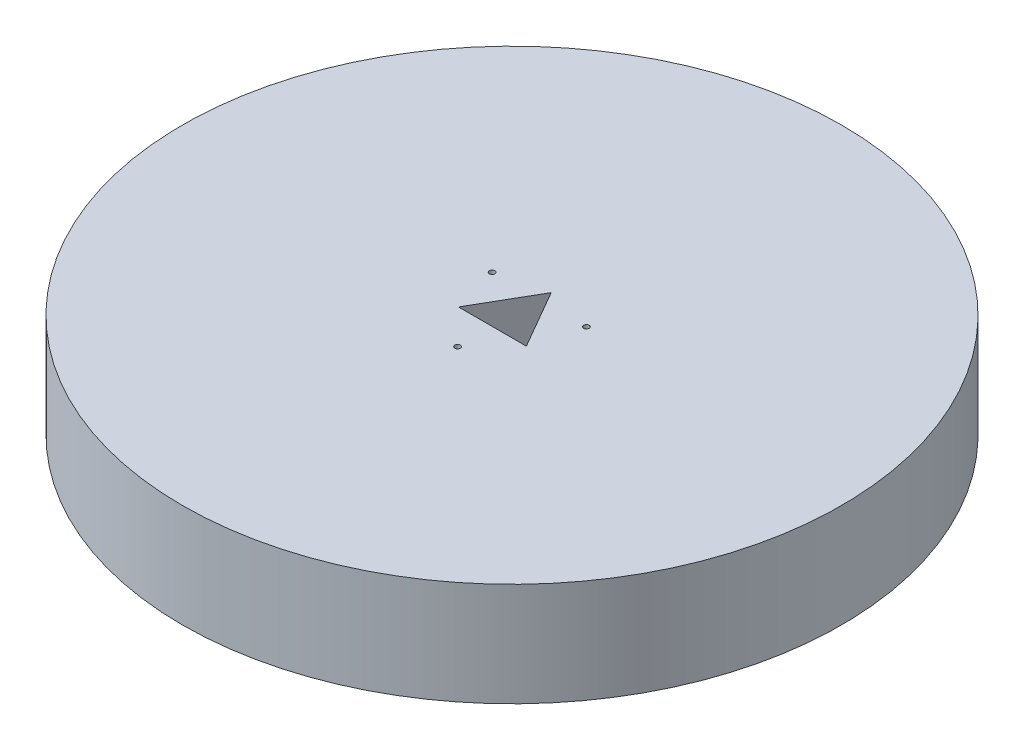
ISO-10303-21;
HEADER;
FILE_DESCRIPTION(('STEP AP214'),'2;1');
FILE_NAME('part.step','',(''),(''),'','','');
FILE_SCHEMA(('AUTOMOTIVE_DESIGN { 1 0 10303 214 1 1 1 1 }'));
ENDSEC;
DATA;
#1=APPLICATION_CONTEXT('core data for automotive mechanical design processes');
#2=APPLICATION_PROTOCOL_DEFINITION('international standard','automotive_design',2000,#1);
#3=PRODUCT_CONTEXT('',#1,'mechanical');
#4=PRODUCT('Part','Part','',(#3));
#5=PRODUCT_RELATED_PRODUCT_CATEGORY('part','',(#4));
#6=PRODUCT_DEFINITION_FORMATION('','',#4);
#7=PRODUCT_DEFINITION_CONTEXT('part definition',#1,'design');
#8=PRODUCT_DEFINITION('design','',#6,#7);
#9=PRODUCT_DEFINITION_SHAPE('','',#8);
#10=(LENGTH_UNIT() NAMED_UNIT(*) SI_UNIT(.MILLI.,.METRE.));
#11=(NAMED_UNIT(*) PLANE_ANGLE_UNIT() SI_UNIT($,.RADIAN.));
#12=(NAMED_UNIT(*) SI_UNIT($,.STERADIAN.) SOLID_ANGLE_UNIT());
#13=UNCERTAINTY_MEASURE_WITH_UNIT(LENGTH_MEASURE(1.E-05),#10,'distance_accuracy_value','');
#14=(GEOMETRIC_REPRESENTATION_CONTEXT(3) GLOBAL_UNCERTAINTY_ASSIGNED_CONTEXT((#13)) GLOBAL_UNIT_ASSIGNED_CONTEXT((#10,
#11,#12)) REPRESENTATION_CONTEXT('',''));
#15=CARTESIAN_POINT('',(0.,0.,0.));
#16=DIRECTION('',(0.,0.,1.));
#17=DIRECTION('',(1.,0.,0.));
#18=AXIS2_PLACEMENT_3D('',#15,#16,#17);
#19=CARTESIAN_POINT('',(0.,19.,0.));
#20=DIRECTION('',(0.,-1.,0.));
#21=DIRECTION('',(0.,0.,-1.));
#22=AXIS2_PLACEMENT_3D('',#19,#20,#21);
#23=CYLINDRICAL_SURFACE('',#22,60.5);
#24=CARTESIAN_POINT('',(0.,19.,0.));
#25=DIRECTION('',(0.,1.,0.));
#26=DIRECTION('',(0.,0.,1.));
#27=AXIS2_PLACEMENT_3D('',#24,#25,#26);
#28=CIRCLE('',#27,60.5);
#29=CARTESIAN_POINT('',(0.,19.,60.5));
#30=VERTEX_POINT('',#29);
#31=EDGE_CURVE('E11',#30,#30,#28,.T.);
#32=ORIENTED_EDGE('',*,*,#31,.F.);
#33=EDGE_LOOP('',(#32));
#34=FACE_BOUND('',#33,.T.);
#35=CARTESIAN_POINT('',(0.,0.,0.));
#36=DIRECTION('',(0.,1.,0.));
#37=DIRECTION('',(0.,0.,1.));
#38=AXIS2_PLACEMENT_3D('',#35,#36,#37);
#39=CIRCLE('',#38,60.5);
#40=CARTESIAN_POINT('',(0.,0.,60.5));
#41=VERTEX_POINT('',#40);
#42=EDGE_CURVE('E36',#41,#41,#39,.T.);
#43=ORIENTED_EDGE('',*,*,#42,.T.);
#44=EDGE_LOOP('',(#43));
#45=FACE_BOUND('',#44,.T.);
#46=ADVANCED_FACE('F33',(#34,#45),#23,.T.);
#47=CARTESIAN_POINT('',(0.,19.,0.));
#48=DIRECTION('',(0.,1.,0.));
#49=DIRECTION('',(0.,0.,1.));
#50=AXIS2_PLACEMENT_3D('',#47,#48,#49);
#51=PLANE('',#50);
#52=CARTESIAN_POINT('',(6.62314556491545E-13,19.,9.99999999999964));
#53=DIRECTION('',(0.,1.,0.));
#54=DIRECTION('',(0.,0.,1.));
#55=AXIS2_PLACEMENT_3D('',#52,#53,#54);
#56=CIRCLE('',#55,0.5);
#57=CARTESIAN_POINT('',(6.62314556491545E-13,19.,10.4999999999996));
#58=VERTEX_POINT('',#57);
#59=EDGE_CURVE('E142',#58,#58,#56,.T.);
#60=ORIENTED_EDGE('',*,*,#59,.F.);
#61=EDGE_LOOP('',(#60));
#62=FACE_BOUND('',#61,.T.);
#63=CARTESIAN_POINT('',(8.66025403784437,19.,-5.00000000000076));
#64=DIRECTION('',(0.,1.,0.));
#65=DIRECTION('',(0.,0.,1.));
#66=AXIS2_PLACEMENT_3D('',#63,#64,#65);
#67=CIRCLE('',#66,0.500000000000001);
#68=CARTESIAN_POINT('',(8.66025403784437,19.,-4.50000000000075));
#69=VERTEX_POINT('',#68);
#70=EDGE_CURVE('E144',#69,#69,#67,.T.);
#71=ORIENTED_EDGE('',*,*,#70,.F.);
#72=EDGE_LOOP('',(#71));
#73=FACE_BOUND('',#72,.T.);
#74=CARTESIAN_POINT('',(-8.6602540378444,19.,-4.99999999999998));
#75=DIRECTION('',(0.,1.,0.));
#76=DIRECTION('',(0.,0.,1.));
#77=AXIS2_PLACEMENT_3D('',#74,#75,#76);
#78=CIRCLE('',#77,0.500000000000001);
#79=CARTESIAN_POINT('',(-8.6602540378444,19.,-4.49999999999998));
#80=VERTEX_POINT('',#79);
#81=EDGE_CURVE('E88',#80,#80,#78,.T.);
#82=ORIENTED_EDGE('',*,*,#81,.F.);
#83=EDGE_LOOP('',(#82));
#84=FACE_BOUND('',#83,.T.);
#85=DIRECTION('',(-0.500000000000001,0.,0.866025403784438));
#86=VECTOR('',#85,1.);
#87=CARTESIAN_POINT('',(-6.23538290724796,19.,3.59999999999998));
#88=LINE('',#87,#86);
#89=CARTESIAN_POINT('',(0.,19.,-7.2));
#90=VERTEX_POINT('',#89);
#91=CARTESIAN_POINT('',(-6.23538290724796,19.,3.59999999999998));
#92=VERTEX_POINT('',#91);
#93=EDGE_CURVE('E47',#90,#92,#88,.T.);
#94=ORIENTED_EDGE('',*,*,#93,.F.);
#95=DIRECTION('',(-0.500000000000001,0.,-0.866025403784438));
#96=VECTOR('',#95,1.);
#97=CARTESIAN_POINT('',(0.,19.,-7.2));
#98=LINE('',#97,#96);
#99=CARTESIAN_POINT('',(6.23538290724797,19.,3.59999999999998));
#100=VERTEX_POINT('',#99);
#101=EDGE_CURVE('E82',#100,#90,#98,.T.);
#102=ORIENTED_EDGE('',*,*,#101,.F.);
#103=DIRECTION('',(1.,0.,0.));
#104=VECTOR('',#103,1.);
#105=CARTESIAN_POINT('',(6.23538290724797,19.,3.59999999999998));
#106=LINE('',#105,#104);
#107=EDGE_CURVE('E85',#92,#100,#106,.T.);
#108=ORIENTED_EDGE('',*,*,#107,.F.);
#109=EDGE_LOOP('',(#94,#102,#108));
#110=FACE_BOUND('',#109,.T.);
#111=ORIENTED_EDGE('',*,*,#31,.T.);
#112=EDGE_LOOP('',(#111));
#113=FACE_BOUND('',#112,.T.);
#114=ADVANCED_FACE('F100',(#62,#73,#84,#110,#113),#51,.T.);
#115=CARTESIAN_POINT('',(0.,0.,0.));
#116=DIRECTION('',(0.,1.,0.));
#117=DIRECTION('',(0.,0.,1.));
#118=AXIS2_PLACEMENT_3D('',#115,#116,#117);
#119=PLANE('',#118);
#120=CARTESIAN_POINT('',(6.62314556491545E-13,0.,9.99999999999964));
#121=DIRECTION('',(0.,1.,0.));
#122=DIRECTION('',(0.,0.,1.));
#123=AXIS2_PLACEMENT_3D('',#120,#121,#122);
#124=CIRCLE('',#123,0.5);
#125=CARTESIAN_POINT('',(6.62314556491545E-13,0.,10.4999999999996));
#126=VERTEX_POINT('',#125);
#127=EDGE_CURVE('E139',#126,#126,#124,.T.);
#128=ORIENTED_EDGE('',*,*,#127,.T.);
#129=EDGE_LOOP('',(#128));
#130=FACE_BOUND('',#129,.T.);
#131=CARTESIAN_POINT('',(8.66025403784437,0.,-5.00000000000076));
#132=DIRECTION('',(0.,1.,0.));
#133=DIRECTION('',(0.,0.,1.));
#134=AXIS2_PLACEMENT_3D('',#131,#132,#133);
#135=CIRCLE('',#134,0.500000000000001);
#136=CARTESIAN_POINT('',(8.66025403784437,0.,-4.50000000000075));
#137=VERTEX_POINT('',#136);
#138=EDGE_CURVE('E147',#137,#137,#135,.T.);
#139=ORIENTED_EDGE('',*,*,#138,.T.);
#140=EDGE_LOOP('',(#139));
#141=FACE_BOUND('',#140,.T.);
#142=CARTESIAN_POINT('',(-8.6602540378444,0.,-4.99999999999998));
#143=DIRECTION('',(0.,1.,0.));
#144=DIRECTION('',(0.,0.,1.));
#145=AXIS2_PLACEMENT_3D('',#142,#143,#144);
#146=CIRCLE('',#145,0.500000000000001);
#147=CARTESIAN_POINT('',(-8.6602540378444,0.,-4.49999999999998));
#148=VERTEX_POINT('',#147);
#149=EDGE_CURVE('E93',#148,#148,#146,.T.);
#150=ORIENTED_EDGE('',*,*,#149,.T.);
#151=EDGE_LOOP('',(#150));
#152=FACE_BOUND('',#151,.T.);
#153=DIRECTION('',(-0.500000000000001,0.,-0.866025403784438));
#154=VECTOR('',#153,1.);
#155=CARTESIAN_POINT('',(0.,0.,-7.2));
#156=LINE('',#155,#154);
#157=CARTESIAN_POINT('',(6.23538290724797,0.,3.59999999999998));
#158=VERTEX_POINT('',#157);
#159=CARTESIAN_POINT('',(0.,0.,-7.2));
#160=VERTEX_POINT('',#159);
#161=EDGE_CURVE('E55',#158,#160,#156,.T.);
#162=ORIENTED_EDGE('',*,*,#161,.T.);
#163=DIRECTION('',(-0.500000000000001,0.,0.866025403784438));
#164=VECTOR('',#163,1.);
#165=CARTESIAN_POINT('',(-6.23538290724796,0.,3.59999999999998));
#166=LINE('',#165,#164);
#167=CARTESIAN_POINT('',(-6.23538290724796,0.,3.59999999999998));
#168=VERTEX_POINT('',#167);
#169=EDGE_CURVE('E69',#160,#168,#166,.T.);
#170=ORIENTED_EDGE('',*,*,#169,.T.);
#171=DIRECTION('',(1.,0.,0.));
#172=VECTOR('',#171,1.);
#173=CARTESIAN_POINT('',(6.23538290724797,0.,3.59999999999998));
#174=LINE('',#173,#172);
#175=EDGE_CURVE('E76',#168,#158,#174,.T.);
#176=ORIENTED_EDGE('',*,*,#175,.T.);
#177=EDGE_LOOP('',(#162,#170,#176));
#178=FACE_BOUND('',#177,.T.);
#179=ORIENTED_EDGE('',*,*,#42,.F.);
#180=EDGE_LOOP('',(#179));
#181=FACE_BOUND('',#180,.T.);
#182=ADVANCED_FACE('F80',(#130,#141,#152,#178,#181),#119,.F.);
#183=CARTESIAN_POINT('',(-6.23538290724796,0.,3.59999999999998));
#184=DIRECTION('',(-0.866025403784438,0.,-0.500000000000001));
#185=DIRECTION('',(-0.500000000000001,0.,0.866025403784438));
#186=AXIS2_PLACEMENT_3D('',#183,#184,#185);
#187=PLANE('',#186);
#188=ORIENTED_EDGE('',*,*,#93,.T.);
#189=DIRECTION('',(0.,1.,0.));
#190=VECTOR('',#189,1.);
#191=CARTESIAN_POINT('',(-6.23538290724796,0.,3.59999999999998));
#192=LINE('',#191,#190);
#193=EDGE_CURVE('E65',#168,#92,#192,.T.);
#194=ORIENTED_EDGE('',*,*,#193,.F.);
#195=ORIENTED_EDGE('',*,*,#169,.F.);
#196=DIRECTION('',(0.,1.,0.));
#197=VECTOR('',#196,1.);
#198=CARTESIAN_POINT('',(0.,0.,-7.2));
#199=LINE('',#198,#197);
#200=EDGE_CURVE('E95',#160,#90,#199,.T.);
#201=ORIENTED_EDGE('',*,*,#200,.T.);
#202=EDGE_LOOP('',(#188,#194,#195,#201));
#203=FACE_BOUND('',#202,.T.);
#204=ADVANCED_FACE('F67',(#203),#187,.F.);
#205=CARTESIAN_POINT('',(0.,0.,-7.2));
#206=DIRECTION('',(0.866025403784438,0.,-0.500000000000001));
#207=DIRECTION('',(-0.500000000000001,0.,-0.866025403784438));
#208=AXIS2_PLACEMENT_3D('',#205,#206,#207);
#209=PLANE('',#208);
#210=ORIENTED_EDGE('',*,*,#101,.T.);
#211=ORIENTED_EDGE('',*,*,#200,.F.);
#212=ORIENTED_EDGE('',*,*,#161,.F.);
#213=DIRECTION('',(0.,1.,0.));
#214=VECTOR('',#213,1.);
#215=CARTESIAN_POINT('',(6.23538290724797,0.,3.59999999999998));
#216=LINE('',#215,#214);
#217=EDGE_CURVE('E73',#158,#100,#216,.T.);
#218=ORIENTED_EDGE('',*,*,#217,.T.);
#219=EDGE_LOOP('',(#210,#211,#212,#218));
#220=FACE_BOUND('',#219,.T.);
#221=ADVANCED_FACE('F97',(#220),#209,.F.);
#222=CARTESIAN_POINT('',(6.23538290724797,0.,3.59999999999998));
#223=DIRECTION('',(0.,0.,1.));
#224=DIRECTION('',(1.,0.,0.));
#225=AXIS2_PLACEMENT_3D('',#222,#223,#224);
#226=PLANE('',#225);
#227=ORIENTED_EDGE('',*,*,#107,.T.);
#228=ORIENTED_EDGE('',*,*,#217,.F.);
#229=ORIENTED_EDGE('',*,*,#175,.F.);
#230=ORIENTED_EDGE('',*,*,#193,.T.);
#231=EDGE_LOOP('',(#227,#228,#229,#230));
#232=FACE_BOUND('',#231,.T.);
#233=ADVANCED_FACE('F77',(#232),#226,.F.);
#234=CARTESIAN_POINT('',(-8.6602540378444,0.,-4.99999999999998));
#235=DIRECTION('',(0.,1.,0.));
#236=DIRECTION('',(0.,0.,1.));
#237=AXIS2_PLACEMENT_3D('',#234,#235,#236);
#238=CYLINDRICAL_SURFACE('',#237,0.500000000000001);
#239=ORIENTED_EDGE('',*,*,#149,.F.);
#240=EDGE_LOOP('',(#239));
#241=FACE_BOUND('',#240,.T.);
#242=ORIENTED_EDGE('',*,*,#81,.T.);
#243=EDGE_LOOP('',(#242));
#244=FACE_BOUND('',#243,.T.);
#245=ADVANCED_FACE('F122',(#241,#244),#238,.F.);
#246=CARTESIAN_POINT('',(8.66025403784437,0.,-5.00000000000076));
#247=DIRECTION('',(0.,1.,0.));
#248=DIRECTION('',(0.,0.,1.));
#249=AXIS2_PLACEMENT_3D('',#246,#247,#248);
#250=CYLINDRICAL_SURFACE('',#249,0.500000000000001);
#251=ORIENTED_EDGE('',*,*,#138,.F.);
#252=EDGE_LOOP('',(#251));
#253=FACE_BOUND('',#252,.T.);
#254=ORIENTED_EDGE('',*,*,#70,.T.);
#255=EDGE_LOOP('',(#254));
#256=FACE_BOUND('',#255,.T.);
#257=ADVANCED_FACE('F127',(#253,#256),#250,.F.);
#258=CARTESIAN_POINT('',(6.62314556491545E-13,0.,9.99999999999964));
#259=DIRECTION('',(0.,1.,0.));
#260=DIRECTION('',(0.,0.,1.));
#261=AXIS2_PLACEMENT_3D('',#258,#259,#260);
#262=CYLINDRICAL_SURFACE('',#261,0.5);
#263=ORIENTED_EDGE('',*,*,#127,.F.);
#264=EDGE_LOOP('',(#263));
#265=FACE_BOUND('',#264,.T.);
#266=ORIENTED_EDGE('',*,*,#59,.T.);
#267=EDGE_LOOP('',(#266));
#268=FACE_BOUND('',#267,.T.);
#269=ADVANCED_FACE('F131',(#265,#268),#262,.F.);
#270=CLOSED_SHELL('',(#46,#114,#182,#204,#221,#233,#245,#257,#269));
#271=MANIFOLD_SOLID_BREP('B2',#270);
#272=ADVANCED_BREP_SHAPE_REPRESENTATION('',(#18,#271),#14);
#273=SHAPE_DEFINITION_REPRESENTATION(#9,#272);
ENDSEC;
END-ISO-10303-21;
